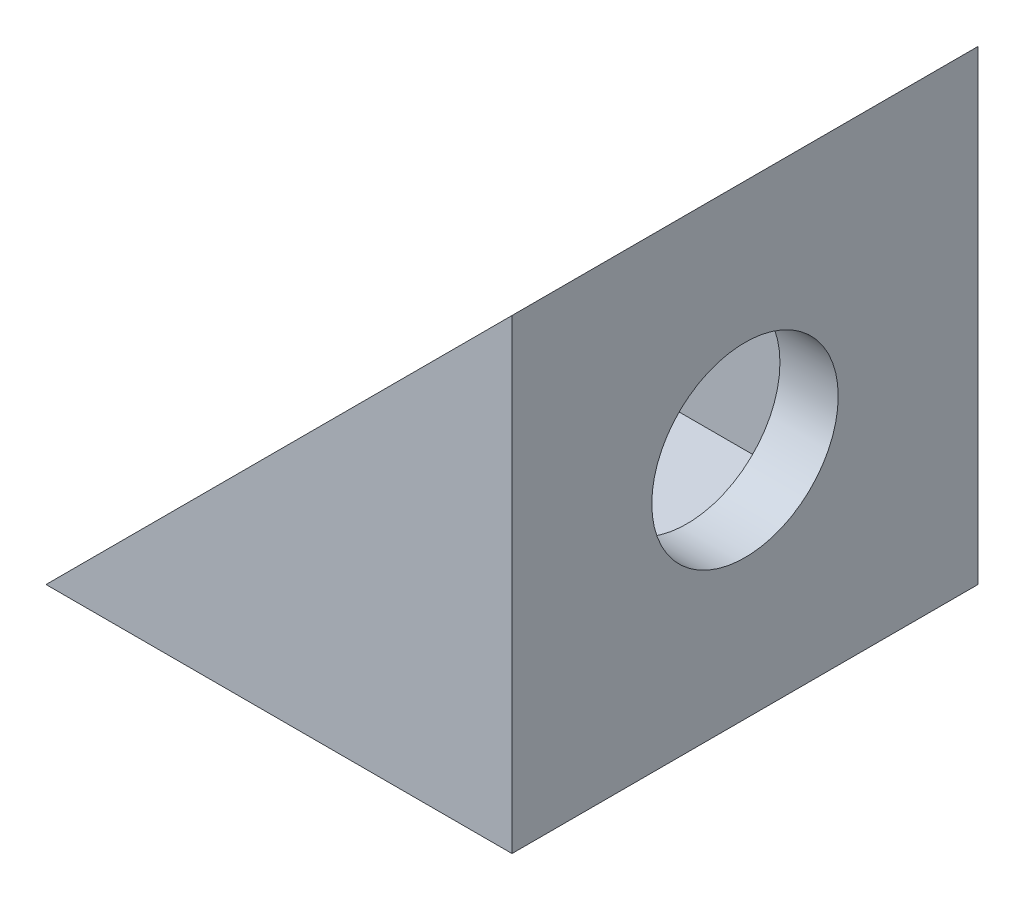
ISO-10303-21;
HEADER;
FILE_DESCRIPTION(('STEP AP214'),'2;1');
FILE_NAME('part.step','',(''),(''),'','','');
FILE_SCHEMA(('AUTOMOTIVE_DESIGN { 1 0 10303 214 1 1 1 1 }'));
ENDSEC;
DATA;
#1=APPLICATION_CONTEXT('core data for automotive mechanical design processes');
#2=APPLICATION_PROTOCOL_DEFINITION('international standard','automotive_design',2000,#1);
#3=PRODUCT_CONTEXT('',#1,'mechanical');
#4=PRODUCT('Part','Part','',(#3));
#5=PRODUCT_RELATED_PRODUCT_CATEGORY('part','',(#4));
#6=PRODUCT_DEFINITION_FORMATION('','',#4);
#7=PRODUCT_DEFINITION_CONTEXT('part definition',#1,'design');
#8=PRODUCT_DEFINITION('design','',#6,#7);
#9=PRODUCT_DEFINITION_SHAPE('','',#8);
#10=(LENGTH_UNIT() NAMED_UNIT(*) SI_UNIT(.MILLI.,.METRE.));
#11=(NAMED_UNIT(*) PLANE_ANGLE_UNIT() SI_UNIT($,.RADIAN.));
#12=(NAMED_UNIT(*) SI_UNIT($,.STERADIAN.) SOLID_ANGLE_UNIT());
#13=UNCERTAINTY_MEASURE_WITH_UNIT(LENGTH_MEASURE(1.E-05),#10,'distance_accuracy_value','');
#14=(GEOMETRIC_REPRESENTATION_CONTEXT(3) GLOBAL_UNCERTAINTY_ASSIGNED_CONTEXT((#13)) GLOBAL_UNIT_ASSIGNED_CONTEXT((#10,
#11,#12)) REPRESENTATION_CONTEXT('',''));
#15=CARTESIAN_POINT('',(0.,0.,0.));
#16=DIRECTION('',(0.,0.,1.));
#17=DIRECTION('',(1.,0.,0.));
#18=AXIS2_PLACEMENT_3D('',#15,#16,#17);
#19=CARTESIAN_POINT('',(0.,20.,0.));
#20=DIRECTION('',(0.,-1.,0.));
#21=DIRECTION('',(0.,0.,-1.));
#22=AXIS2_PLACEMENT_3D('',#19,#20,#21);
#23=CYLINDRICAL_SURFACE('',#22,4.);
#24=CARTESIAN_POINT('',(0.,0.,0.));
#25=DIRECTION('',(0.,-1.,0.));
#26=DIRECTION('',(0.,0.,-1.));
#27=AXIS2_PLACEMENT_3D('',#24,#25,#26);
#28=CIRCLE('',#27,4.);
#29=CARTESIAN_POINT('',(0.,0.,-4.));
#30=VERTEX_POINT('',#29);
#31=EDGE_CURVE('E127',#30,#30,#28,.T.);
#32=ORIENTED_EDGE('',*,*,#31,.T.);
#33=EDGE_LOOP('',(#32));
#34=FACE_BOUND('',#33,.T.);
#35=CARTESIAN_POINT('',(0.,2.5,0.));
#36=DIRECTION('',(0.,1.,0.));
#37=DIRECTION('',(0.,0.,1.));
#38=AXIS2_PLACEMENT_3D('',#35,#36,#37);
#39=CIRCLE('',#38,4.);
#40=CARTESIAN_POINT('',(0.,2.5,4.));
#41=VERTEX_POINT('',#40);
#42=EDGE_CURVE('E103',#41,#41,#39,.F.);
#43=ORIENTED_EDGE('',*,*,#42,.F.);
#44=EDGE_LOOP('',(#43));
#45=FACE_BOUND('',#44,.T.);
#46=ADVANCED_FACE('F41',(#34,#45),#23,.F.);
#47=CARTESIAN_POINT('',(10.,20.,-10.));
#48=DIRECTION('',(-1.,0.,0.));
#49=DIRECTION('',(0.,0.,1.));
#50=AXIS2_PLACEMENT_3D('',#47,#48,#49);
#51=PLANE('',#50);
#52=CARTESIAN_POINT('',(10.,10.,0.));
#53=DIRECTION('',(1.,0.,0.));
#54=DIRECTION('',(0.,0.,-1.));
#55=AXIS2_PLACEMENT_3D('',#52,#53,#54);
#56=CIRCLE('',#55,4.);
#57=CARTESIAN_POINT('',(10.,10.,-4.));
#58=VERTEX_POINT('',#57);
#59=EDGE_CURVE('E132',#58,#58,#56,.T.);
#60=ORIENTED_EDGE('',*,*,#59,.F.);
#61=EDGE_LOOP('',(#60));
#62=FACE_BOUND('',#61,.T.);
#63=DIRECTION('',(0.,0.,-1.));
#64=VECTOR('',#63,1.);
#65=CARTESIAN_POINT('',(10.,0.,-10.));
#66=LINE('',#65,#64);
#67=CARTESIAN_POINT('',(10.,0.,10.));
#68=VERTEX_POINT('',#67);
#69=CARTESIAN_POINT('',(10.,0.,-10.));
#70=VERTEX_POINT('',#69);
#71=EDGE_CURVE('E143',#68,#70,#66,.T.);
#72=ORIENTED_EDGE('',*,*,#71,.T.);
#73=DIRECTION('',(0.,-1.,0.));
#74=VECTOR('',#73,1.);
#75=CARTESIAN_POINT('',(10.,20.,-10.));
#76=LINE('',#75,#74);
#77=CARTESIAN_POINT('',(10.,20.,-10.));
#78=VERTEX_POINT('',#77);
#79=EDGE_CURVE('E162',#78,#70,#76,.T.);
#80=ORIENTED_EDGE('',*,*,#79,.F.);
#81=DIRECTION('',(0.,0.,-1.));
#82=VECTOR('',#81,1.);
#83=CARTESIAN_POINT('',(10.,20.,-10.));
#84=LINE('',#83,#82);
#85=CARTESIAN_POINT('',(10.,20.,10.));
#86=VERTEX_POINT('',#85);
#87=EDGE_CURVE('E144',#86,#78,#84,.T.);
#88=ORIENTED_EDGE('',*,*,#87,.F.);
#89=DIRECTION('',(0.,-1.,0.));
#90=VECTOR('',#89,1.);
#91=CARTESIAN_POINT('',(10.,20.,10.));
#92=LINE('',#91,#90);
#93=EDGE_CURVE('E147',#86,#68,#92,.T.);
#94=ORIENTED_EDGE('',*,*,#93,.T.);
#95=EDGE_LOOP('',(#72,#80,#88,#94));
#96=FACE_BOUND('',#95,.T.);
#97=ADVANCED_FACE('F43',(#62,#96),#51,.F.);
#98=CARTESIAN_POINT('',(-10.,20.,-10.));
#99=DIRECTION('',(0.,0.,1.));
#100=DIRECTION('',(1.,0.,0.));
#101=AXIS2_PLACEMENT_3D('',#98,#99,#100);
#102=PLANE('',#101);
#103=DIRECTION('',(-1.,0.,0.));
#104=VECTOR('',#103,1.);
#105=CARTESIAN_POINT('',(-10.,0.,-10.));
#106=LINE('',#105,#104);
#107=CARTESIAN_POINT('',(-10.,0.,-10.));
#108=VERTEX_POINT('',#107);
#109=EDGE_CURVE('E151',#70,#108,#106,.T.);
#110=ORIENTED_EDGE('',*,*,#109,.T.);
#111=DIRECTION('',(0.707106781186548,0.707106781186547,0.));
#112=VECTOR('',#111,1.);
#113=CARTESIAN_POINT('',(-10.,0.,-10.));
#114=LINE('',#113,#112);
#115=EDGE_CURVE('E136',#108,#78,#114,.T.);
#116=ORIENTED_EDGE('',*,*,#115,.T.);
#117=ORIENTED_EDGE('',*,*,#79,.T.);
#118=EDGE_LOOP('',(#110,#116,#117));
#119=FACE_BOUND('',#118,.T.);
#120=ADVANCED_FACE('F198',(#119),#102,.F.);
#121=CARTESIAN_POINT('',(-10.,20.,10.));
#122=DIRECTION('',(0.,0.,-1.));
#123=DIRECTION('',(-1.,0.,0.));
#124=AXIS2_PLACEMENT_3D('',#121,#122,#123);
#125=PLANE('',#124);
#126=ORIENTED_EDGE('',*,*,#93,.F.);
#127=DIRECTION('',(-0.707106781186548,-0.707106781186547,0.));
#128=VECTOR('',#127,1.);
#129=CARTESIAN_POINT('',(0.,10.,10.));
#130=LINE('',#129,#128);
#131=CARTESIAN_POINT('',(-10.,0.,10.));
#132=VERTEX_POINT('',#131);
#133=EDGE_CURVE('E140',#86,#132,#130,.T.);
#134=ORIENTED_EDGE('',*,*,#133,.T.);
#135=DIRECTION('',(1.,0.,0.));
#136=VECTOR('',#135,1.);
#137=CARTESIAN_POINT('',(-10.,0.,10.));
#138=LINE('',#137,#136);
#139=EDGE_CURVE('E65',#132,#68,#138,.T.);
#140=ORIENTED_EDGE('',*,*,#139,.T.);
#141=EDGE_LOOP('',(#126,#134,#140));
#142=FACE_BOUND('',#141,.T.);
#143=ADVANCED_FACE('F208',(#142),#125,.F.);
#144=CARTESIAN_POINT('',(0.,0.,0.));
#145=DIRECTION('',(0.,1.,0.));
#146=DIRECTION('',(0.,0.,1.));
#147=AXIS2_PLACEMENT_3D('',#144,#145,#146);
#148=PLANE('',#147);
#149=ORIENTED_EDGE('',*,*,#31,.F.);
#150=EDGE_LOOP('',(#149));
#151=FACE_BOUND('',#150,.T.);
#152=ORIENTED_EDGE('',*,*,#71,.F.);
#153=ORIENTED_EDGE('',*,*,#139,.F.);
#154=DIRECTION('',(0.,0.,1.));
#155=VECTOR('',#154,1.);
#156=CARTESIAN_POINT('',(-10.,0.,-10.));
#157=LINE('',#156,#155);
#158=EDGE_CURVE('E155',#108,#132,#157,.T.);
#159=ORIENTED_EDGE('',*,*,#158,.F.);
#160=ORIENTED_EDGE('',*,*,#109,.F.);
#161=EDGE_LOOP('',(#152,#153,#159,#160));
#162=FACE_BOUND('',#161,.T.);
#163=ADVANCED_FACE('F205',(#151,#162),#148,.F.);
#164=CARTESIAN_POINT('',(-10.,0.,-10.));
#165=DIRECTION('',(0.707106781186547,-0.707106781186548,0.));
#166=DIRECTION('',(0.707106781186548,0.707106781186547,0.));
#167=AXIS2_PLACEMENT_3D('',#164,#165,#166);
#168=PLANE('',#167);
#169=DIRECTION('',(0.,0.,1.));
#170=VECTOR('',#169,1.);
#171=CARTESIAN_POINT('',(7.5,17.5,-10.));
#172=LINE('',#171,#170);
#173=CARTESIAN_POINT('',(7.5,17.5,-7.5));
#174=VERTEX_POINT('',#173);
#175=CARTESIAN_POINT('',(7.5,17.5,7.5));
#176=VERTEX_POINT('',#175);
#177=EDGE_CURVE('E117',#174,#176,#172,.T.);
#178=ORIENTED_EDGE('',*,*,#177,.T.);
#179=DIRECTION('',(-0.707106781186548,-0.707106781186547,0.));
#180=VECTOR('',#179,1.);
#181=CARTESIAN_POINT('',(-10.,0.,7.5));
#182=LINE('',#181,#180);
#183=CARTESIAN_POINT('',(-7.5,2.5,7.5));
#184=VERTEX_POINT('',#183);
#185=EDGE_CURVE('E12',#176,#184,#182,.T.);
#186=ORIENTED_EDGE('',*,*,#185,.T.);
#187=DIRECTION('',(0.,0.,-1.));
#188=VECTOR('',#187,1.);
#189=CARTESIAN_POINT('',(-7.5,2.5,7.5));
#190=LINE('',#189,#188);
#191=CARTESIAN_POINT('',(-7.5,2.5,-7.5));
#192=VERTEX_POINT('',#191);
#193=EDGE_CURVE('E122',#184,#192,#190,.T.);
#194=ORIENTED_EDGE('',*,*,#193,.T.);
#195=DIRECTION('',(0.707106781186548,0.707106781186547,0.));
#196=VECTOR('',#195,1.);
#197=CARTESIAN_POINT('',(-10.,0.,-7.5));
#198=LINE('',#197,#196);
#199=EDGE_CURVE('E50',#192,#174,#198,.T.);
#200=ORIENTED_EDGE('',*,*,#199,.T.);
#201=EDGE_LOOP('',(#178,#186,#194,#200));
#202=FACE_BOUND('',#201,.T.);
#203=ORIENTED_EDGE('',*,*,#87,.T.);
#204=ORIENTED_EDGE('',*,*,#115,.F.);
#205=ORIENTED_EDGE('',*,*,#158,.T.);
#206=ORIENTED_EDGE('',*,*,#133,.F.);
#207=EDGE_LOOP('',(#203,#204,#205,#206));
#208=FACE_BOUND('',#207,.T.);
#209=ADVANCED_FACE('F173',(#202,#208),#168,.F.);
#210=CARTESIAN_POINT('',(-10.,10.,0.));
#211=DIRECTION('',(1.,0.,0.));
#212=DIRECTION('',(0.,0.,-1.));
#213=AXIS2_PLACEMENT_3D('',#210,#211,#212);
#214=CYLINDRICAL_SURFACE('',#213,4.);
#215=CARTESIAN_POINT('',(7.5,10.,0.));
#216=DIRECTION('',(1.,0.,0.));
#217=DIRECTION('',(0.,0.,-1.));
#218=AXIS2_PLACEMENT_3D('',#215,#216,#217);
#219=CIRCLE('',#218,4.);
#220=CARTESIAN_POINT('',(7.5,10.,-4.));
#221=VERTEX_POINT('',#220);
#222=EDGE_CURVE('E128',#221,#221,#219,.F.);
#223=ORIENTED_EDGE('',*,*,#222,.T.);
#224=EDGE_LOOP('',(#223));
#225=FACE_BOUND('',#224,.T.);
#226=ORIENTED_EDGE('',*,*,#59,.T.);
#227=EDGE_LOOP('',(#226));
#228=FACE_BOUND('',#227,.T.);
#229=ADVANCED_FACE('F182',(#225,#228),#214,.F.);
#230=CARTESIAN_POINT('',(-7.5,-21.2132034355964,7.5));
#231=DIRECTION('',(0.,0.,1.));
#232=DIRECTION('',(1.,0.,0.));
#233=AXIS2_PLACEMENT_3D('',#230,#231,#232);
#234=PLANE('',#233);
#235=DIRECTION('',(0.,1.,0.));
#236=VECTOR('',#235,1.);
#237=CARTESIAN_POINT('',(7.5,-21.2132034355964,7.5));
#238=LINE('',#237,#236);
#239=CARTESIAN_POINT('',(7.5,2.5,7.5));
#240=VERTEX_POINT('',#239);
#241=EDGE_CURVE('E119',#240,#176,#238,.T.);
#242=ORIENTED_EDGE('',*,*,#241,.F.);
#243=DIRECTION('',(-1.,0.,0.));
#244=VECTOR('',#243,1.);
#245=CARTESIAN_POINT('',(-7.5,2.5,7.5));
#246=LINE('',#245,#244);
#247=EDGE_CURVE('E109',#240,#184,#246,.T.);
#248=ORIENTED_EDGE('',*,*,#247,.T.);
#249=ORIENTED_EDGE('',*,*,#185,.F.);
#250=EDGE_LOOP('',(#242,#248,#249));
#251=FACE_BOUND('',#250,.T.);
#252=ADVANCED_FACE('F180',(#251),#234,.F.);
#253=CARTESIAN_POINT('',(-7.5,-21.2132034355964,-7.5));
#254=DIRECTION('',(0.,0.,-1.));
#255=DIRECTION('',(-1.,0.,0.));
#256=AXIS2_PLACEMENT_3D('',#253,#254,#255);
#257=PLANE('',#256);
#258=DIRECTION('',(1.,0.,0.));
#259=VECTOR('',#258,1.);
#260=CARTESIAN_POINT('',(-7.5,2.5,-7.5));
#261=LINE('',#260,#259);
#262=CARTESIAN_POINT('',(7.5,2.5,-7.5));
#263=VERTEX_POINT('',#262);
#264=EDGE_CURVE('E57',#192,#263,#261,.T.);
#265=ORIENTED_EDGE('',*,*,#264,.T.);
#266=DIRECTION('',(0.,1.,0.));
#267=VECTOR('',#266,1.);
#268=CARTESIAN_POINT('',(7.5,-21.2132034355964,-7.5));
#269=LINE('',#268,#267);
#270=EDGE_CURVE('E99',#263,#174,#269,.T.);
#271=ORIENTED_EDGE('',*,*,#270,.T.);
#272=ORIENTED_EDGE('',*,*,#199,.F.);
#273=EDGE_LOOP('',(#265,#271,#272));
#274=FACE_BOUND('',#273,.T.);
#275=ADVANCED_FACE('F97',(#274),#257,.F.);
#276=CARTESIAN_POINT('',(7.5,-21.2132034355964,7.5));
#277=DIRECTION('',(1.,0.,0.));
#278=DIRECTION('',(0.,0.,-1.));
#279=AXIS2_PLACEMENT_3D('',#276,#277,#278);
#280=PLANE('',#279);
#281=ORIENTED_EDGE('',*,*,#222,.F.);
#282=EDGE_LOOP('',(#281));
#283=FACE_BOUND('',#282,.T.);
#284=ORIENTED_EDGE('',*,*,#270,.F.);
#285=DIRECTION('',(0.,0.,1.));
#286=VECTOR('',#285,1.);
#287=CARTESIAN_POINT('',(7.5,2.5,7.5));
#288=LINE('',#287,#286);
#289=EDGE_CURVE('E104',#263,#240,#288,.T.);
#290=ORIENTED_EDGE('',*,*,#289,.T.);
#291=ORIENTED_EDGE('',*,*,#241,.T.);
#292=ORIENTED_EDGE('',*,*,#177,.F.);
#293=EDGE_LOOP('',(#284,#290,#291,#292));
#294=FACE_BOUND('',#293,.T.);
#295=ADVANCED_FACE('F115',(#283,#294),#280,.F.);
#296=CARTESIAN_POINT('',(0.,2.5,0.));
#297=DIRECTION('',(0.,1.,0.));
#298=DIRECTION('',(0.,0.,1.));
#299=AXIS2_PLACEMENT_3D('',#296,#297,#298);
#300=PLANE('',#299);
#301=ORIENTED_EDGE('',*,*,#289,.F.);
#302=ORIENTED_EDGE('',*,*,#264,.F.);
#303=ORIENTED_EDGE('',*,*,#193,.F.);
#304=ORIENTED_EDGE('',*,*,#247,.F.);
#305=EDGE_LOOP('',(#301,#302,#303,#304));
#306=FACE_BOUND('',#305,.T.);
#307=ORIENTED_EDGE('',*,*,#42,.T.);
#308=EDGE_LOOP('',(#307));
#309=FACE_BOUND('',#308,.T.);
#310=ADVANCED_FACE('F107',(#306,#309),#300,.T.);
#311=CLOSED_SHELL('',(#46,#97,#120,#143,#163,#209,#229,#252,#275,#295,#310));
#312=MANIFOLD_SOLID_BREP('B2',#311);
#313=ADVANCED_BREP_SHAPE_REPRESENTATION('',(#18,#312),#14);
#314=SHAPE_DEFINITION_REPRESENTATION(#9,#313);
ENDSEC;
END-ISO-10303-21;
